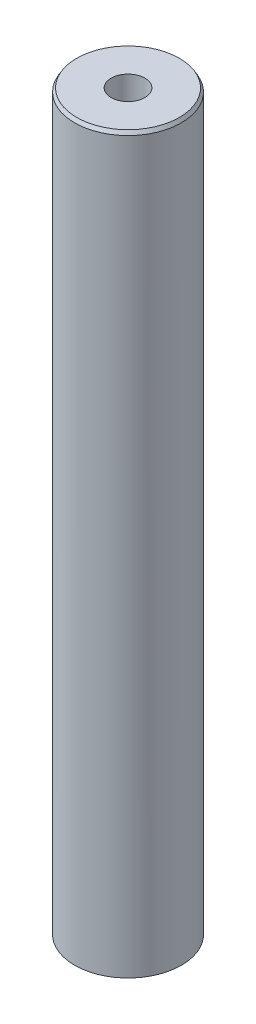
ISO-10303-21;
HEADER;
FILE_DESCRIPTION(('STEP AP214'),'2;1');
FILE_NAME('part.step','',(''),(''),'','','');
FILE_SCHEMA(('AUTOMOTIVE_DESIGN { 1 0 10303 214 1 1 1 1 }'));
ENDSEC;
DATA;
#1=APPLICATION_CONTEXT('core data for automotive mechanical design processes');
#2=APPLICATION_PROTOCOL_DEFINITION('international standard','automotive_design',2000,#1);
#3=PRODUCT_CONTEXT('',#1,'mechanical');
#4=PRODUCT('Part','Part','',(#3));
#5=PRODUCT_RELATED_PRODUCT_CATEGORY('part','',(#4));
#6=PRODUCT_DEFINITION_FORMATION('','',#4);
#7=PRODUCT_DEFINITION_CONTEXT('part definition',#1,'design');
#8=PRODUCT_DEFINITION('design','',#6,#7);
#9=PRODUCT_DEFINITION_SHAPE('','',#8);
#10=(LENGTH_UNIT() NAMED_UNIT(*) SI_UNIT(.MILLI.,.METRE.));
#11=(NAMED_UNIT(*) PLANE_ANGLE_UNIT() SI_UNIT($,.RADIAN.));
#12=(NAMED_UNIT(*) SI_UNIT($,.STERADIAN.) SOLID_ANGLE_UNIT());
#13=UNCERTAINTY_MEASURE_WITH_UNIT(LENGTH_MEASURE(1.E-05),#10,'distance_accuracy_value','');
#14=(GEOMETRIC_REPRESENTATION_CONTEXT(3) GLOBAL_UNCERTAINTY_ASSIGNED_CONTEXT((#13)) GLOBAL_UNIT_ASSIGNED_CONTEXT((#10,
#11,#12)) REPRESENTATION_CONTEXT('',''));
#15=CARTESIAN_POINT('',(0.,0.,0.));
#16=DIRECTION('',(0.,0.,1.));
#17=DIRECTION('',(1.,0.,0.));
#18=AXIS2_PLACEMENT_3D('',#15,#16,#17);
#19=CARTESIAN_POINT('',(0.,550.872729426313,0.));
#20=DIRECTION('',(0.,-1.,0.));
#21=DIRECTION('',(0.,0.,-1.));
#22=AXIS2_PLACEMENT_3D('',#19,#20,#21);
#23=CYLINDRICAL_SURFACE('',#22,40.);
#24=CARTESIAN_POINT('',(0.,548.168063285775,0.));
#25=DIRECTION('',(0.,1.,0.));
#26=DIRECTION('',(0.,0.,1.));
#27=AXIS2_PLACEMENT_3D('',#24,#25,#26);
#28=CIRCLE('',#27,40.);
#29=CARTESIAN_POINT('',(0.,548.168063285775,-40.));
#30=VERTEX_POINT('',#29);
#31=EDGE_CURVE('E50',#30,#30,#28,.F.);
#32=ORIENTED_EDGE('',*,*,#31,.T.);
#33=EDGE_LOOP('',(#32));
#34=FACE_BOUND('',#33,.T.);
#35=CARTESIAN_POINT('',(0.,1.56153972430784,0.));
#36=DIRECTION('',(0.,1.,0.));
#37=DIRECTION('',(0.,0.,1.));
#38=AXIS2_PLACEMENT_3D('',#35,#36,#37);
#39=CIRCLE('',#38,40.);
#40=CARTESIAN_POINT('',(0.,1.56153972430784,40.));
#41=VERTEX_POINT('',#40);
#42=EDGE_CURVE('E51',#41,#41,#39,.T.);
#43=ORIENTED_EDGE('',*,*,#42,.T.);
#44=EDGE_LOOP('',(#43));
#45=FACE_BOUND('',#44,.T.);
#46=ADVANCED_FACE('F39',(#34,#45),#23,.T.);
#47=CARTESIAN_POINT('',(0.,550.872729426313,0.));
#48=DIRECTION('',(0.,1.,0.));
#49=DIRECTION('',(0.,0.,1.));
#50=AXIS2_PLACEMENT_3D('',#47,#48,#49);
#51=PLANE('',#50);
#52=CARTESIAN_POINT('',(0.,550.872729426313,0.));
#53=DIRECTION('',(0.,1.,0.));
#54=DIRECTION('',(0.,0.,1.));
#55=AXIS2_PLACEMENT_3D('',#52,#53,#54);
#56=CIRCLE('',#55,38.438460275692);
#57=CARTESIAN_POINT('',(0.,550.872729426313,-38.4384602756921));
#58=VERTEX_POINT('',#57);
#59=EDGE_CURVE('E54',#58,#58,#56,.T.);
#60=ORIENTED_EDGE('',*,*,#59,.T.);
#61=EDGE_LOOP('',(#60));
#62=FACE_BOUND('',#61,.T.);
#63=CARTESIAN_POINT('',(0.,550.872729426313,0.));
#64=DIRECTION('',(0.,1.,0.));
#65=DIRECTION('',(0.,0.,1.));
#66=AXIS2_PLACEMENT_3D('',#63,#64,#65);
#67=CIRCLE('',#66,12.6491853272434);
#68=CARTESIAN_POINT('',(0.,550.872729426313,12.6491853272434));
#69=VERTEX_POINT('',#68);
#70=EDGE_CURVE('E58',#69,#69,#67,.T.);
#71=ORIENTED_EDGE('',*,*,#70,.F.);
#72=EDGE_LOOP('',(#71));
#73=FACE_BOUND('',#72,.T.);
#74=ADVANCED_FACE('F69',(#62,#73),#51,.T.);
#75=CARTESIAN_POINT('',(0.,0.,0.));
#76=DIRECTION('',(0.,1.,0.));
#77=DIRECTION('',(0.,0.,1.));
#78=AXIS2_PLACEMENT_3D('',#75,#76,#77);
#79=PLANE('',#78);
#80=CARTESIAN_POINT('',(0.,0.,0.));
#81=DIRECTION('',(0.,1.,0.));
#82=DIRECTION('',(0.,0.,1.));
#83=AXIS2_PLACEMENT_3D('',#80,#81,#82);
#84=CIRCLE('',#83,37.2953338594617);
#85=CARTESIAN_POINT('',(0.,0.,37.2953338594617));
#86=VERTEX_POINT('',#85);
#87=EDGE_CURVE('E10',#86,#86,#84,.F.);
#88=ORIENTED_EDGE('',*,*,#87,.T.);
#89=EDGE_LOOP('',(#88));
#90=FACE_BOUND('',#89,.T.);
#91=CARTESIAN_POINT('',(0.,0.,0.));
#92=DIRECTION('',(0.,1.,0.));
#93=DIRECTION('',(0.,0.,1.));
#94=AXIS2_PLACEMENT_3D('',#91,#92,#93);
#95=CIRCLE('',#94,12.6491853272434);
#96=CARTESIAN_POINT('',(0.,0.,12.6491853272434));
#97=VERTEX_POINT('',#96);
#98=EDGE_CURVE('E63',#97,#97,#95,.T.);
#99=ORIENTED_EDGE('',*,*,#98,.T.);
#100=EDGE_LOOP('',(#99));
#101=FACE_BOUND('',#100,.T.);
#102=ADVANCED_FACE('F75',(#90,#101),#79,.F.);
#103=CARTESIAN_POINT('',(0.,550.872729426313,0.));
#104=DIRECTION('',(0.,-1.,0.));
#105=DIRECTION('',(0.,0.,-1.));
#106=AXIS2_PLACEMENT_3D('',#103,#104,#105);
#107=CYLINDRICAL_SURFACE('',#106,12.6491853272434);
#108=ORIENTED_EDGE('',*,*,#70,.T.);
#109=EDGE_LOOP('',(#108));
#110=FACE_BOUND('',#109,.T.);
#111=ORIENTED_EDGE('',*,*,#98,.F.);
#112=EDGE_LOOP('',(#111));
#113=FACE_BOUND('',#112,.T.);
#114=ADVANCED_FACE('F70',(#110,#113),#107,.F.);
#115=CARTESIAN_POINT('',(0.,550.872729426313,0.));
#116=DIRECTION('',(0.,-1.,0.));
#117=DIRECTION('',(0.,0.,-1.));
#118=AXIS2_PLACEMENT_3D('',#115,#116,#117);
#119=CONICAL_SURFACE('',#118,38.438460275692,0.523598775598309);
#120=CARTESIAN_POINT('',(0.,548.168063285775,-40.));
#121=CARTESIAN_POINT('',(0.,548.196236891406,-39.9837339612052));
#122=CARTESIAN_POINT('',(0.,548.224410497036,-39.9674679224103));
#123=CARTESIAN_POINT('',(0.,548.280757708297,-39.9349358448205));
#124=CARTESIAN_POINT('',(0.,548.308931313928,-39.9186698060257));
#125=CARTESIAN_POINT('',(0.,548.365278525189,-39.8861377284359));
#126=CARTESIAN_POINT('',(0.,548.39345213082,-39.869871689641));
#127=CARTESIAN_POINT('',(0.,548.449799342081,-39.8373396120513));
#128=CARTESIAN_POINT('',(0.,548.477972947712,-39.8210735732564));
#129=CARTESIAN_POINT('',(0.,548.534320158973,-39.7885414956667));
#130=CARTESIAN_POINT('',(0.,548.562493764603,-39.7722754568718));
#131=CARTESIAN_POINT('',(0.,548.618840975865,-39.739743379282));
#132=CARTESIAN_POINT('',(0.,548.647014581495,-39.7234773404872));
#133=CARTESIAN_POINT('',(0.,548.703361792756,-39.6909452628974));
#134=CARTESIAN_POINT('',(0.,548.731535398387,-39.6746792241025));
#135=CARTESIAN_POINT('',(0.,548.787882609648,-39.6421471465128));
#136=CARTESIAN_POINT('',(0.,548.816056215279,-39.6258811077179));
#137=CARTESIAN_POINT('',(0.,548.87240342654,-39.5933490301282));
#138=CARTESIAN_POINT('',(0.,548.900577032171,-39.5770829913333));
#139=CARTESIAN_POINT('',(0.,548.956924243432,-39.5445509137435));
#140=CARTESIAN_POINT('',(0.,548.985097849063,-39.5282848749487));
#141=CARTESIAN_POINT('',(0.,549.041445060324,-39.4957527973589));
#142=CARTESIAN_POINT('',(0.,549.069618665954,-39.479486758564));
#143=CARTESIAN_POINT('',(0.,549.125965877216,-39.4469546809743));
#144=CARTESIAN_POINT('',(0.,549.154139482846,-39.4306886421794));
#145=CARTESIAN_POINT('',(0.,549.210486694107,-39.3981565645897));
#146=CARTESIAN_POINT('',(0.,549.238660299738,-39.3818905257948));
#147=CARTESIAN_POINT('',(0.,549.295007510999,-39.3493584482051));
#148=CARTESIAN_POINT('',(0.,549.32318111663,-39.3330924094102));
#149=CARTESIAN_POINT('',(0.,549.379528327891,-39.3005603318204));
#150=CARTESIAN_POINT('',(0.,549.407701933522,-39.2842942930255));
#151=CARTESIAN_POINT('',(0.,549.464049144783,-39.2517622154358));
#152=CARTESIAN_POINT('',(0.,549.492222750414,-39.2354961766409));
#153=CARTESIAN_POINT('',(0.,549.548569961675,-39.2029640990512));
#154=CARTESIAN_POINT('',(0.,549.576743567305,-39.1866980602563));
#155=CARTESIAN_POINT('',(0.,549.633090778566,-39.1541659826666));
#156=CARTESIAN_POINT('',(0.,549.661264384197,-39.1378999438717));
#157=CARTESIAN_POINT('',(0.,549.717611595458,-39.1053678662819));
#158=CARTESIAN_POINT('',(0.,549.745785201089,-39.089101827487));
#159=CARTESIAN_POINT('',(0.,549.80213241235,-39.0565697498973));
#160=CARTESIAN_POINT('',(0.,549.830306017981,-39.0403037111024));
#161=CARTESIAN_POINT('',(0.,549.886653229242,-39.0077716335127));
#162=CARTESIAN_POINT('',(0.,549.914826834873,-38.9915055947178));
#163=CARTESIAN_POINT('',(0.,549.971174046134,-38.9589735171281));
#164=CARTESIAN_POINT('',(0.,549.999347651765,-38.9427074783332));
#165=CARTESIAN_POINT('',(0.,550.055694863026,-38.9101754007434));
#166=CARTESIAN_POINT('',(0.,550.083868468656,-38.8939093619486));
#167=CARTESIAN_POINT('',(0.,550.140215679917,-38.8613772843588));
#168=CARTESIAN_POINT('',(0.,550.168389285548,-38.8451112455639));
#169=CARTESIAN_POINT('',(0.,550.224736496809,-38.8125791679742));
#170=CARTESIAN_POINT('',(0.,550.25291010244,-38.7963131291793));
#171=CARTESIAN_POINT('',(0.,550.309257313701,-38.7637810515896));
#172=CARTESIAN_POINT('',(0.,550.337430919332,-38.7475150127947));
#173=CARTESIAN_POINT('',(0.,550.393778130593,-38.7149829352049));
#174=CARTESIAN_POINT('',(0.,550.421951736224,-38.6987168964101));
#175=CARTESIAN_POINT('',(0.,550.478298947485,-38.6661848188203));
#176=CARTESIAN_POINT('',(0.,550.506472553115,-38.6499187800254));
#177=CARTESIAN_POINT('',(0.,550.562819764377,-38.6173867024357));
#178=CARTESIAN_POINT('',(0.,550.590993370007,-38.6011206636408));
#179=CARTESIAN_POINT('',(0.,550.647340581268,-38.5685885860511));
#180=CARTESIAN_POINT('',(0.,550.675514186899,-38.5523225472562));
#181=CARTESIAN_POINT('',(0.,550.73186139816,-38.5197904696664));
#182=CARTESIAN_POINT('',(0.,550.760035003791,-38.5035244308716));
#183=CARTESIAN_POINT('',(0.,550.816382215052,-38.4709923532818));
#184=CARTESIAN_POINT('',(0.,550.844555820683,-38.4547263144869));
#185=CARTESIAN_POINT('',(0.,550.872729426313,-38.4384602756921));
#186=B_SPLINE_CURVE_WITH_KNOTS('',3,(#120,#121,#122,#123,#124,#125,#126,#127,#128,#129,#130,
#131,#132,#133,#134,#135,#136,#137,#138,#139,#140,#141,#142,#143,#144,#145,#146,#147,#148,#149,
#150,#151,#152,#153,#154,#155,#156,#157,#158,#159,#160,#161,#162,#163,#164,#165,#166,#167,#168,
#169,#170,#171,#172,#173,#174,#175,#176,#177,#178,#179,#180,#181,#182,#183,#184,#185),
.UNSPECIFIED.,.F.,.F.,(4,2,2,2,2,2,2,2,2,2,2,2,2,2,2,2,2,2,2,2,2,2,2,2,2,2,2,2,2,2,2,2,4),(0.,
0.0975962327692327,0.195192465538465,0.292788698307695,0.390384931076927,0.487981163846157,
0.585577396615389,0.683173629384718,0.780769862153948,0.87836609492318,0.97596232769241,
1.07355856046164,1.17115479323087,1.2687510260002,1.36634725876943,1.46394349153866,
1.56153972430789,1.65913595707712,1.75673218984636,1.85432842261559,1.95192465538491,
2.04952088815415,2.14711712092338,2.24471335369261,2.34230958646184,2.43990581923107,
2.5375020520004,2.63509828476963,2.73269451753886,2.8302907503081,2.92788698307732,
3.02548321584656,3.12307944861588),.UNSPECIFIED.);
#187=EDGE_CURVE('BSEAM81',#30,#58,#186,.T.);
#188=ORIENTED_EDGE('',*,*,#31,.F.);
#189=ORIENTED_EDGE('',*,*,#59,.F.);
#190=ORIENTED_EDGE('',*,*,#187,.T.);
#191=ORIENTED_EDGE('',*,*,#187,.F.);
#192=EDGE_LOOP('',(#188,#190,#189,#191));
#193=FACE_BOUND('',#192,.T.);
#194=ADVANCED_FACE('F81',(#193),#119,.T.);
#195=CARTESIAN_POINT('',(0.,1.56153972430784,0.));
#196=DIRECTION('',(0.,1.,0.));
#197=DIRECTION('',(0.,0.,1.));
#198=AXIS2_PLACEMENT_3D('',#195,#196,#197);
#199=CONICAL_SURFACE('',#198,40.,1.04719755119661);
#200=ORIENTED_EDGE('',*,*,#87,.F.);
#201=EDGE_LOOP('',(#200));
#202=FACE_BOUND('',#201,.T.);
#203=ORIENTED_EDGE('',*,*,#42,.F.);
#204=EDGE_LOOP('',(#203));
#205=FACE_BOUND('',#204,.T.);
#206=ADVANCED_FACE('F45',(#202,#205),#199,.T.);
#207=CLOSED_SHELL('',(#46,#74,#102,#114,#194,#206));
#208=MANIFOLD_SOLID_BREP('B2',#207);
#209=ADVANCED_BREP_SHAPE_REPRESENTATION('',(#18,#208),#14);
#210=SHAPE_DEFINITION_REPRESENTATION(#9,#209);
ENDSEC;
END-ISO-10303-21;
